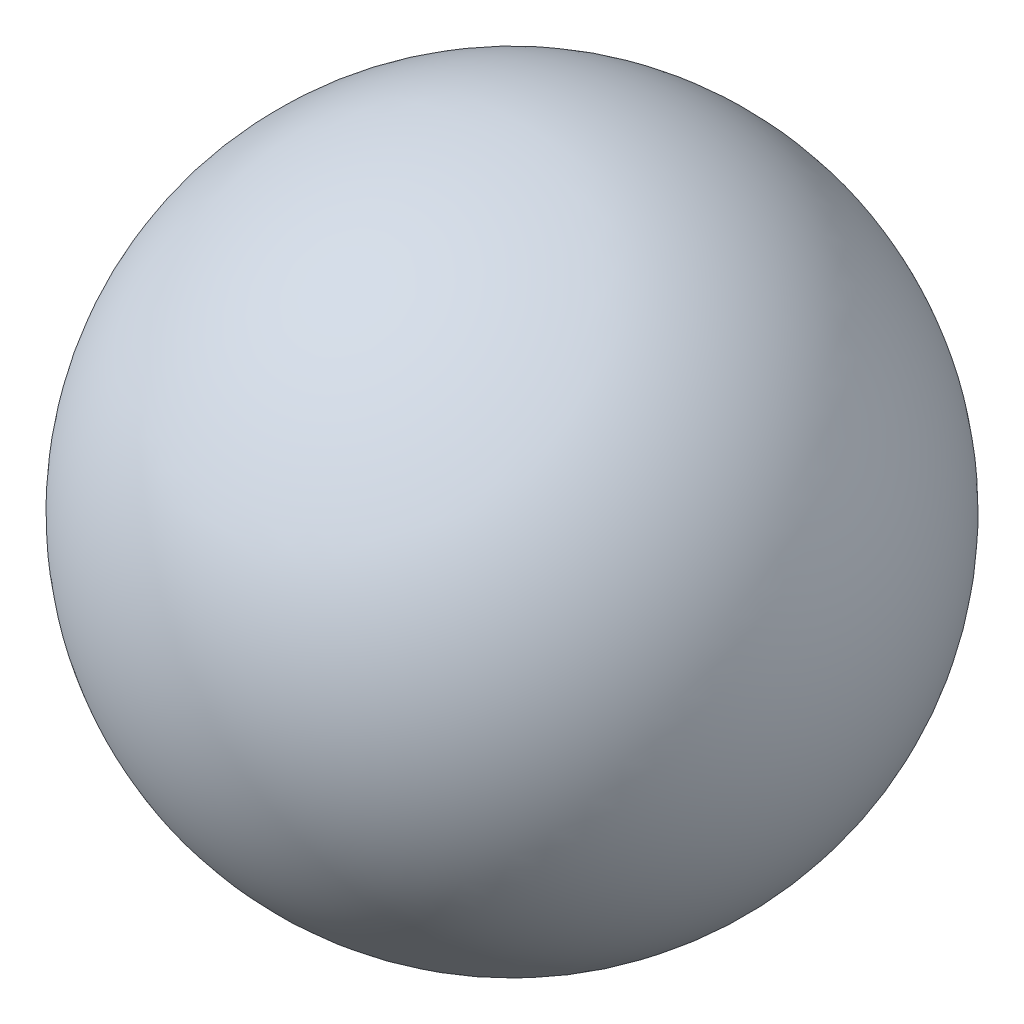
ISO-10303-21;
HEADER;
FILE_DESCRIPTION(('STEP AP214'),'2;1');
FILE_NAME('part.step','',(''),(''),'','','');
FILE_SCHEMA(('AUTOMOTIVE_DESIGN { 1 0 10303 214 1 1 1 1 }'));
ENDSEC;
DATA;
#1=APPLICATION_CONTEXT('core data for automotive mechanical design processes');
#2=APPLICATION_PROTOCOL_DEFINITION('international standard','automotive_design',2000,#1);
#3=PRODUCT_CONTEXT('',#1,'mechanical');
#4=PRODUCT('Part','Part','',(#3));
#5=PRODUCT_RELATED_PRODUCT_CATEGORY('part','',(#4));
#6=PRODUCT_DEFINITION_FORMATION('','',#4);
#7=PRODUCT_DEFINITION_CONTEXT('part definition',#1,'design');
#8=PRODUCT_DEFINITION('design','',#6,#7);
#9=PRODUCT_DEFINITION_SHAPE('','',#8);
#10=(LENGTH_UNIT() NAMED_UNIT(*) SI_UNIT(.MILLI.,.METRE.));
#11=(NAMED_UNIT(*) PLANE_ANGLE_UNIT() SI_UNIT($,.RADIAN.));
#12=(NAMED_UNIT(*) SI_UNIT($,.STERADIAN.) SOLID_ANGLE_UNIT());
#13=UNCERTAINTY_MEASURE_WITH_UNIT(LENGTH_MEASURE(1.E-05),#10,'distance_accuracy_value','');
#14=(GEOMETRIC_REPRESENTATION_CONTEXT(3) GLOBAL_UNCERTAINTY_ASSIGNED_CONTEXT((#13)) GLOBAL_UNIT_ASSIGNED_CONTEXT((#10,
#11,#12)) REPRESENTATION_CONTEXT('',''));
#15=CARTESIAN_POINT('',(0.,0.,0.));
#16=DIRECTION('',(0.,0.,1.));
#17=DIRECTION('',(1.,0.,0.));
#18=AXIS2_PLACEMENT_3D('',#15,#16,#17);
#19=CARTESIAN_POINT('',(2.25386045473143,-3.,-7.67594378891598));
#20=DIRECTION('',(0.,0.,1.));
#21=DIRECTION('',(1.,0.,0.));
#22=AXIS2_PLACEMENT_3D('',#19,#20,#21);
#23=SPHERICAL_SURFACE('',#22,1.8);
#24=CARTESIAN_POINT('',(2.25386045473143,-3.,-5.87594378891598));
#25=VERTEX_POINT('',#24);
#26=VERTEX_LOOP('',#25);
#27=FACE_BOUND('',#26,.T.);
#28=ADVANCED_FACE('F12',(#27),#23,.T.);
#29=CLOSED_SHELL('',(#28));
#30=MANIFOLD_SOLID_BREP('B1',#29);
#31=ADVANCED_BREP_SHAPE_REPRESENTATION('',(#18,#30),#14);
#32=SHAPE_DEFINITION_REPRESENTATION(#9,#31);
ENDSEC;
END-ISO-10303-21;
